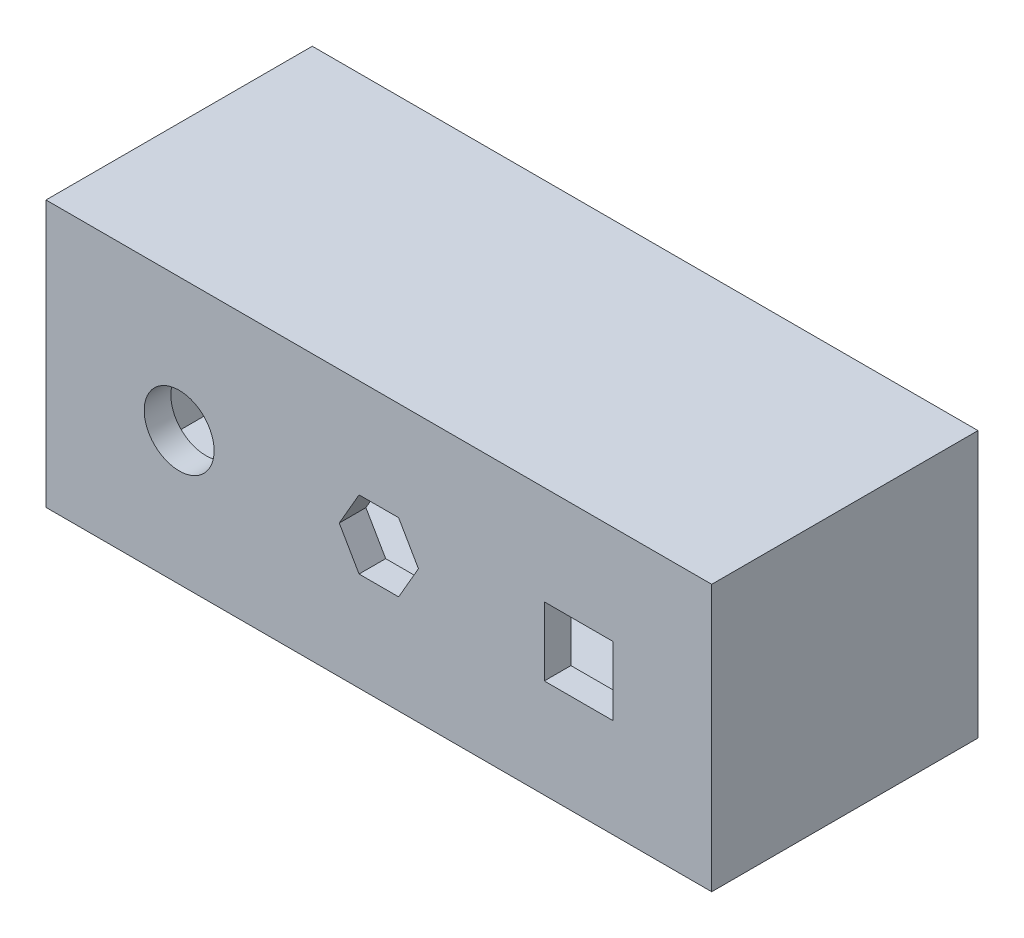
ISO-10303-21;
HEADER;
FILE_DESCRIPTION(('STEP AP214'),'2;1');
FILE_NAME('part.step','',(''),(''),'','','');
FILE_SCHEMA(('AUTOMOTIVE_DESIGN { 1 0 10303 214 1 1 1 1 }'));
ENDSEC;
DATA;
#1=APPLICATION_CONTEXT('core data for automotive mechanical design processes');
#2=APPLICATION_PROTOCOL_DEFINITION('international standard','automotive_design',2000,#1);
#3=PRODUCT_CONTEXT('',#1,'mechanical');
#4=PRODUCT('Part','Part','',(#3));
#5=PRODUCT_RELATED_PRODUCT_CATEGORY('part','',(#4));
#6=PRODUCT_DEFINITION_FORMATION('','',#4);
#7=PRODUCT_DEFINITION_CONTEXT('part definition',#1,'design');
#8=PRODUCT_DEFINITION('design','',#6,#7);
#9=PRODUCT_DEFINITION_SHAPE('','',#8);
#10=(LENGTH_UNIT() NAMED_UNIT(*) SI_UNIT(.MILLI.,.METRE.));
#11=(NAMED_UNIT(*) PLANE_ANGLE_UNIT() SI_UNIT($,.RADIAN.));
#12=(NAMED_UNIT(*) SI_UNIT($,.STERADIAN.) SOLID_ANGLE_UNIT());
#13=UNCERTAINTY_MEASURE_WITH_UNIT(LENGTH_MEASURE(1.E-05),#10,'distance_accuracy_value','');
#14=(GEOMETRIC_REPRESENTATION_CONTEXT(3) GLOBAL_UNCERTAINTY_ASSIGNED_CONTEXT((#13)) GLOBAL_UNIT_ASSIGNED_CONTEXT((#10,
#11,#12)) REPRESENTATION_CONTEXT('',''));
#15=CARTESIAN_POINT('',(0.,0.,0.));
#16=DIRECTION('',(0.,0.,1.));
#17=DIRECTION('',(1.,0.,0.));
#18=AXIS2_PLACEMENT_3D('',#15,#16,#17);
#19=CARTESIAN_POINT('',(0.,0.,0.));
#20=DIRECTION('',(0.,0.,-1.));
#21=DIRECTION('',(-1.,0.,0.));
#22=AXIS2_PLACEMENT_3D('',#19,#20,#21);
#23=PLANE('',#22);
#24=DIRECTION('',(0.,1.,0.));
#25=VECTOR('',#24,1.);
#26=CARTESIAN_POINT('',(250.,-100.,0.));
#27=LINE('',#26,#25);
#28=CARTESIAN_POINT('',(250.,-100.,0.));
#29=VERTEX_POINT('',#28);
#30=CARTESIAN_POINT('',(250.,100.,0.));
#31=VERTEX_POINT('',#30);
#32=EDGE_CURVE('E227',#29,#31,#27,.T.);
#33=ORIENTED_EDGE('',*,*,#32,.F.);
#34=DIRECTION('',(1.,0.,0.));
#35=VECTOR('',#34,1.);
#36=CARTESIAN_POINT('',(-250.,-100.,0.));
#37=LINE('',#36,#35);
#38=CARTESIAN_POINT('',(-250.,-100.,0.));
#39=VERTEX_POINT('',#38);
#40=EDGE_CURVE('E260',#39,#29,#37,.T.);
#41=ORIENTED_EDGE('',*,*,#40,.F.);
#42=DIRECTION('',(0.,-1.,0.));
#43=VECTOR('',#42,1.);
#44=CARTESIAN_POINT('',(-250.,-100.,0.));
#45=LINE('',#44,#43);
#46=CARTESIAN_POINT('',(-250.,100.,0.));
#47=VERTEX_POINT('',#46);
#48=EDGE_CURVE('E271',#47,#39,#45,.T.);
#49=ORIENTED_EDGE('',*,*,#48,.F.);
#50=DIRECTION('',(-1.,0.,0.));
#51=VECTOR('',#50,1.);
#52=CARTESIAN_POINT('',(-250.,100.,0.));
#53=LINE('',#52,#51);
#54=EDGE_CURVE('E269',#31,#47,#53,.T.);
#55=ORIENTED_EDGE('',*,*,#54,.F.);
#56=EDGE_LOOP('',(#33,#41,#49,#55));
#57=FACE_BOUND('',#56,.T.);
#58=DIRECTION('',(1.,0.,0.));
#59=VECTOR('',#58,1.);
#60=CARTESIAN_POINT('',(0.,-80.,0.));
#61=LINE('',#60,#59);
#62=CARTESIAN_POINT('',(-230.,-80.,0.));
#63=VERTEX_POINT('',#62);
#64=CARTESIAN_POINT('',(230.,-80.,0.));
#65=VERTEX_POINT('',#64);
#66=EDGE_CURVE('E233',#63,#65,#61,.T.);
#67=ORIENTED_EDGE('',*,*,#66,.T.);
#68=DIRECTION('',(0.,1.,0.));
#69=VECTOR('',#68,1.);
#70=CARTESIAN_POINT('',(230.,0.,0.));
#71=LINE('',#70,#69);
#72=CARTESIAN_POINT('',(230.,80.,0.));
#73=VERTEX_POINT('',#72);
#74=EDGE_CURVE('E245',#65,#73,#71,.T.);
#75=ORIENTED_EDGE('',*,*,#74,.T.);
#76=DIRECTION('',(-1.,0.,0.));
#77=VECTOR('',#76,1.);
#78=CARTESIAN_POINT('',(0.,80.,0.));
#79=LINE('',#78,#77);
#80=CARTESIAN_POINT('',(-230.,80.,0.));
#81=VERTEX_POINT('',#80);
#82=EDGE_CURVE('E248',#73,#81,#79,.T.);
#83=ORIENTED_EDGE('',*,*,#82,.T.);
#84=DIRECTION('',(0.,-1.,0.));
#85=VECTOR('',#84,1.);
#86=CARTESIAN_POINT('',(-230.,0.,0.));
#87=LINE('',#86,#85);
#88=EDGE_CURVE('E251',#81,#63,#87,.T.);
#89=ORIENTED_EDGE('',*,*,#88,.T.);
#90=EDGE_LOOP('',(#67,#75,#83,#89));
#91=FACE_BOUND('',#90,.T.);
#92=ADVANCED_FACE('F37',(#57,#91),#23,.T.);
#93=CARTESIAN_POINT('',(250.,-100.,200.));
#94=DIRECTION('',(-1.,0.,0.));
#95=DIRECTION('',(0.,0.,1.));
#96=AXIS2_PLACEMENT_3D('',#93,#94,#95);
#97=PLANE('',#96);
#98=ORIENTED_EDGE('',*,*,#32,.T.);
#99=DIRECTION('',(0.,0.,-1.));
#100=VECTOR('',#99,1.);
#101=CARTESIAN_POINT('',(250.,100.,200.));
#102=LINE('',#101,#100);
#103=CARTESIAN_POINT('',(250.,100.,200.));
#104=VERTEX_POINT('',#103);
#105=EDGE_CURVE('E282',#104,#31,#102,.T.);
#106=ORIENTED_EDGE('',*,*,#105,.F.);
#107=DIRECTION('',(0.,1.,0.));
#108=VECTOR('',#107,1.);
#109=CARTESIAN_POINT('',(250.,-100.,200.));
#110=LINE('',#109,#108);
#111=CARTESIAN_POINT('',(250.,-100.,200.));
#112=VERTEX_POINT('',#111);
#113=EDGE_CURVE('E256',#112,#104,#110,.T.);
#114=ORIENTED_EDGE('',*,*,#113,.F.);
#115=DIRECTION('',(0.,0.,-1.));
#116=VECTOR('',#115,1.);
#117=CARTESIAN_POINT('',(250.,-100.,200.));
#118=LINE('',#117,#116);
#119=EDGE_CURVE('E266',#112,#29,#118,.T.);
#120=ORIENTED_EDGE('',*,*,#119,.T.);
#121=EDGE_LOOP('',(#98,#106,#114,#120));
#122=FACE_BOUND('',#121,.T.);
#123=ADVANCED_FACE('F39',(#122),#97,.F.);
#124=CARTESIAN_POINT('',(-250.,100.,200.));
#125=DIRECTION('',(0.,-1.,0.));
#126=DIRECTION('',(0.,0.,-1.));
#127=AXIS2_PLACEMENT_3D('',#124,#125,#126);
#128=PLANE('',#127);
#129=ORIENTED_EDGE('',*,*,#54,.T.);
#130=DIRECTION('',(0.,0.,-1.));
#131=VECTOR('',#130,1.);
#132=CARTESIAN_POINT('',(-250.,100.,200.));
#133=LINE('',#132,#131);
#134=CARTESIAN_POINT('',(-250.,100.,200.));
#135=VERTEX_POINT('',#134);
#136=EDGE_CURVE('E279',#135,#47,#133,.T.);
#137=ORIENTED_EDGE('',*,*,#136,.F.);
#138=DIRECTION('',(-1.,0.,0.));
#139=VECTOR('',#138,1.);
#140=CARTESIAN_POINT('',(-250.,100.,200.));
#141=LINE('',#140,#139);
#142=EDGE_CURVE('E259',#104,#135,#141,.T.);
#143=ORIENTED_EDGE('',*,*,#142,.F.);
#144=ORIENTED_EDGE('',*,*,#105,.T.);
#145=EDGE_LOOP('',(#129,#137,#143,#144));
#146=FACE_BOUND('',#145,.T.);
#147=ADVANCED_FACE('F332',(#146),#128,.F.);
#148=CARTESIAN_POINT('',(-250.,-100.,200.));
#149=DIRECTION('',(1.,0.,0.));
#150=DIRECTION('',(0.,0.,-1.));
#151=AXIS2_PLACEMENT_3D('',#148,#149,#150);
#152=PLANE('',#151);
#153=ORIENTED_EDGE('',*,*,#48,.T.);
#154=DIRECTION('',(0.,0.,-1.));
#155=VECTOR('',#154,1.);
#156=CARTESIAN_POINT('',(-250.,-100.,200.));
#157=LINE('',#156,#155);
#158=CARTESIAN_POINT('',(-250.,-100.,200.));
#159=VERTEX_POINT('',#158);
#160=EDGE_CURVE('E276',#159,#39,#157,.T.);
#161=ORIENTED_EDGE('',*,*,#160,.F.);
#162=DIRECTION('',(0.,-1.,0.));
#163=VECTOR('',#162,1.);
#164=CARTESIAN_POINT('',(-250.,-100.,200.));
#165=LINE('',#164,#163);
#166=EDGE_CURVE('E262',#135,#159,#165,.T.);
#167=ORIENTED_EDGE('',*,*,#166,.F.);
#168=ORIENTED_EDGE('',*,*,#136,.T.);
#169=EDGE_LOOP('',(#153,#161,#167,#168));
#170=FACE_BOUND('',#169,.T.);
#171=ADVANCED_FACE('F337',(#170),#152,.F.);
#172=CARTESIAN_POINT('',(-250.,-100.,200.));
#173=DIRECTION('',(0.,1.,0.));
#174=DIRECTION('',(0.,0.,1.));
#175=AXIS2_PLACEMENT_3D('',#172,#173,#174);
#176=PLANE('',#175);
#177=ORIENTED_EDGE('',*,*,#40,.T.);
#178=ORIENTED_EDGE('',*,*,#119,.F.);
#179=DIRECTION('',(1.,0.,0.));
#180=VECTOR('',#179,1.);
#181=CARTESIAN_POINT('',(-250.,-100.,200.));
#182=LINE('',#181,#180);
#183=EDGE_CURVE('E264',#159,#112,#182,.T.);
#184=ORIENTED_EDGE('',*,*,#183,.F.);
#185=ORIENTED_EDGE('',*,*,#160,.T.);
#186=EDGE_LOOP('',(#177,#178,#184,#185));
#187=FACE_BOUND('',#186,.T.);
#188=ADVANCED_FACE('F319',(#187),#176,.F.);
#189=CARTESIAN_POINT('',(0.,0.,200.));
#190=DIRECTION('',(0.,0.,-1.));
#191=DIRECTION('',(-1.,0.,0.));
#192=AXIS2_PLACEMENT_3D('',#189,#190,#191);
#193=PLANE('',#192);
#194=DIRECTION('',(-1.,0.,0.));
#195=VECTOR('',#194,1.);
#196=CARTESIAN_POINT('',(124.25,25.75,200.));
#197=LINE('',#196,#195);
#198=CARTESIAN_POINT('',(175.75,25.75,200.));
#199=VERTEX_POINT('',#198);
#200=CARTESIAN_POINT('',(124.25,25.75,200.));
#201=VERTEX_POINT('',#200);
#202=EDGE_CURVE('E178',#199,#201,#197,.T.);
#203=ORIENTED_EDGE('',*,*,#202,.F.);
#204=DIRECTION('',(0.,1.,0.));
#205=VECTOR('',#204,1.);
#206=CARTESIAN_POINT('',(175.75,-25.7499999999999,200.));
#207=LINE('',#206,#205);
#208=CARTESIAN_POINT('',(175.75,-25.7499999999999,200.));
#209=VERTEX_POINT('',#208);
#210=EDGE_CURVE('E52',#209,#199,#207,.T.);
#211=ORIENTED_EDGE('',*,*,#210,.F.);
#212=DIRECTION('',(1.,0.,0.));
#213=VECTOR('',#212,1.);
#214=CARTESIAN_POINT('',(124.25,-25.7499999999999,200.));
#215=LINE('',#214,#213);
#216=CARTESIAN_POINT('',(124.25,-25.7499999999999,200.));
#217=VERTEX_POINT('',#216);
#218=EDGE_CURVE('E185',#217,#209,#215,.T.);
#219=ORIENTED_EDGE('',*,*,#218,.F.);
#220=DIRECTION('',(0.,-1.,0.));
#221=VECTOR('',#220,1.);
#222=CARTESIAN_POINT('',(124.25,-25.7499999999999,200.));
#223=LINE('',#222,#221);
#224=EDGE_CURVE('E168',#201,#217,#223,.T.);
#225=ORIENTED_EDGE('',*,*,#224,.F.);
#226=EDGE_LOOP('',(#203,#211,#219,#225));
#227=FACE_BOUND('',#226,.T.);
#228=CARTESIAN_POINT('',(-150.,0.,200.));
#229=DIRECTION('',(0.,0.,1.));
#230=DIRECTION('',(1.,0.,0.));
#231=AXIS2_PLACEMENT_3D('',#228,#229,#230);
#232=CIRCLE('',#231,26.25);
#233=CARTESIAN_POINT('',(-123.75,0.,200.));
#234=VERTEX_POINT('',#233);
#235=EDGE_CURVE('E192',#234,#234,#232,.T.);
#236=ORIENTED_EDGE('',*,*,#235,.F.);
#237=EDGE_LOOP('',(#236));
#238=FACE_BOUND('',#237,.T.);
#239=DIRECTION('',(-1.,0.,0.));
#240=VECTOR('',#239,1.);
#241=CARTESIAN_POINT('',(14.8667694316329,25.75,200.));
#242=LINE('',#241,#240);
#243=CARTESIAN_POINT('',(14.8667694316329,25.75,200.));
#244=VERTEX_POINT('',#243);
#245=CARTESIAN_POINT('',(-14.8667694316329,25.75,200.));
#246=VERTEX_POINT('',#245);
#247=EDGE_CURVE('E196',#244,#246,#242,.T.);
#248=ORIENTED_EDGE('',*,*,#247,.F.);
#249=DIRECTION('',(-0.5,0.866025403784439,0.));
#250=VECTOR('',#249,1.);
#251=CARTESIAN_POINT('',(29.7335388632657,0.,200.));
#252=LINE('',#251,#250);
#253=CARTESIAN_POINT('',(29.7335388632657,0.,200.));
#254=VERTEX_POINT('',#253);
#255=EDGE_CURVE('E60',#254,#244,#252,.T.);
#256=ORIENTED_EDGE('',*,*,#255,.F.);
#257=DIRECTION('',(0.5,0.866025403784439,0.));
#258=VECTOR('',#257,1.);
#259=CARTESIAN_POINT('',(14.8667694316329,-25.75,200.));
#260=LINE('',#259,#258);
#261=CARTESIAN_POINT('',(14.8667694316329,-25.75,200.));
#262=VERTEX_POINT('',#261);
#263=EDGE_CURVE('E208',#262,#254,#260,.T.);
#264=ORIENTED_EDGE('',*,*,#263,.F.);
#265=DIRECTION('',(1.,0.,0.));
#266=VECTOR('',#265,1.);
#267=CARTESIAN_POINT('',(-14.8667694316328,-25.75,200.));
#268=LINE('',#267,#266);
#269=CARTESIAN_POINT('',(-14.8667694316328,-25.75,200.));
#270=VERTEX_POINT('',#269);
#271=EDGE_CURVE('E205',#270,#262,#268,.T.);
#272=ORIENTED_EDGE('',*,*,#271,.F.);
#273=DIRECTION('',(0.5,-0.866025403784439,0.));
#274=VECTOR('',#273,1.);
#275=CARTESIAN_POINT('',(-29.7335388632657,0.,200.));
#276=LINE('',#275,#274);
#277=CARTESIAN_POINT('',(-29.7335388632657,0.,200.));
#278=VERTEX_POINT('',#277);
#279=EDGE_CURVE('E202',#278,#270,#276,.T.);
#280=ORIENTED_EDGE('',*,*,#279,.F.);
#281=DIRECTION('',(-0.5,-0.866025403784439,0.));
#282=VECTOR('',#281,1.);
#283=CARTESIAN_POINT('',(-14.8667694316329,25.75,200.));
#284=LINE('',#283,#282);
#285=EDGE_CURVE('E199',#246,#278,#284,.T.);
#286=ORIENTED_EDGE('',*,*,#285,.F.);
#287=EDGE_LOOP('',(#248,#256,#264,#272,#280,#286));
#288=FACE_BOUND('',#287,.T.);
#289=ORIENTED_EDGE('',*,*,#113,.T.);
#290=ORIENTED_EDGE('',*,*,#142,.T.);
#291=ORIENTED_EDGE('',*,*,#166,.T.);
#292=ORIENTED_EDGE('',*,*,#183,.T.);
#293=EDGE_LOOP('',(#289,#290,#291,#292));
#294=FACE_BOUND('',#293,.T.);
#295=ADVANCED_FACE('F182',(#227,#238,#288,#294),#193,.F.);
#296=CARTESIAN_POINT('',(230.,-100.,200.));
#297=DIRECTION('',(-1.,0.,0.));
#298=DIRECTION('',(0.,0.,1.));
#299=AXIS2_PLACEMENT_3D('',#296,#297,#298);
#300=PLANE('',#299);
#301=ORIENTED_EDGE('',*,*,#74,.F.);
#302=DIRECTION('',(0.,0.,-1.));
#303=VECTOR('',#302,1.);
#304=CARTESIAN_POINT('',(230.,-80.,200.));
#305=LINE('',#304,#303);
#306=CARTESIAN_POINT('',(230.,-80.,180.));
#307=VERTEX_POINT('',#306);
#308=EDGE_CURVE('E234',#307,#65,#305,.T.);
#309=ORIENTED_EDGE('',*,*,#308,.F.);
#310=DIRECTION('',(0.,1.,0.));
#311=VECTOR('',#310,1.);
#312=CARTESIAN_POINT('',(230.,0.,180.));
#313=LINE('',#312,#311);
#314=CARTESIAN_POINT('',(230.,80.,180.));
#315=VERTEX_POINT('',#314);
#316=EDGE_CURVE('E229',#307,#315,#313,.T.);
#317=ORIENTED_EDGE('',*,*,#316,.T.);
#318=DIRECTION('',(0.,0.,-1.));
#319=VECTOR('',#318,1.);
#320=CARTESIAN_POINT('',(230.,80.,200.));
#321=LINE('',#320,#319);
#322=EDGE_CURVE('E224',#315,#73,#321,.T.);
#323=ORIENTED_EDGE('',*,*,#322,.T.);
#324=EDGE_LOOP('',(#301,#309,#317,#323));
#325=FACE_BOUND('',#324,.T.);
#326=ADVANCED_FACE('F318',(#325),#300,.T.);
#327=CARTESIAN_POINT('',(-250.,80.,200.));
#328=DIRECTION('',(0.,-1.,0.));
#329=DIRECTION('',(0.,0.,-1.));
#330=AXIS2_PLACEMENT_3D('',#327,#328,#329);
#331=PLANE('',#330);
#332=ORIENTED_EDGE('',*,*,#82,.F.);
#333=ORIENTED_EDGE('',*,*,#322,.F.);
#334=DIRECTION('',(-1.,0.,0.));
#335=VECTOR('',#334,1.);
#336=CARTESIAN_POINT('',(0.,80.,180.));
#337=LINE('',#336,#335);
#338=CARTESIAN_POINT('',(-230.,80.,180.));
#339=VERTEX_POINT('',#338);
#340=EDGE_CURVE('E232',#315,#339,#337,.T.);
#341=ORIENTED_EDGE('',*,*,#340,.T.);
#342=DIRECTION('',(0.,0.,-1.));
#343=VECTOR('',#342,1.);
#344=CARTESIAN_POINT('',(-230.,80.,200.));
#345=LINE('',#344,#343);
#346=EDGE_CURVE('E228',#339,#81,#345,.T.);
#347=ORIENTED_EDGE('',*,*,#346,.T.);
#348=EDGE_LOOP('',(#332,#333,#341,#347));
#349=FACE_BOUND('',#348,.T.);
#350=ADVANCED_FACE('F355',(#349),#331,.T.);
#351=CARTESIAN_POINT('',(-230.,-100.,200.));
#352=DIRECTION('',(1.,0.,0.));
#353=DIRECTION('',(0.,0.,-1.));
#354=AXIS2_PLACEMENT_3D('',#351,#352,#353);
#355=PLANE('',#354);
#356=ORIENTED_EDGE('',*,*,#88,.F.);
#357=ORIENTED_EDGE('',*,*,#346,.F.);
#358=DIRECTION('',(0.,-1.,0.));
#359=VECTOR('',#358,1.);
#360=CARTESIAN_POINT('',(-230.,0.,180.));
#361=LINE('',#360,#359);
#362=CARTESIAN_POINT('',(-230.,-80.,180.));
#363=VERTEX_POINT('',#362);
#364=EDGE_CURVE('E241',#339,#363,#361,.T.);
#365=ORIENTED_EDGE('',*,*,#364,.T.);
#366=DIRECTION('',(0.,0.,-1.));
#367=VECTOR('',#366,1.);
#368=CARTESIAN_POINT('',(-230.,-80.,200.));
#369=LINE('',#368,#367);
#370=EDGE_CURVE('E236',#363,#63,#369,.T.);
#371=ORIENTED_EDGE('',*,*,#370,.T.);
#372=EDGE_LOOP('',(#356,#357,#365,#371));
#373=FACE_BOUND('',#372,.T.);
#374=ADVANCED_FACE('F359',(#373),#355,.T.);
#375=CARTESIAN_POINT('',(-250.,-80.,200.));
#376=DIRECTION('',(0.,1.,0.));
#377=DIRECTION('',(0.,0.,1.));
#378=AXIS2_PLACEMENT_3D('',#375,#376,#377);
#379=PLANE('',#378);
#380=ORIENTED_EDGE('',*,*,#66,.F.);
#381=ORIENTED_EDGE('',*,*,#370,.F.);
#382=DIRECTION('',(1.,0.,0.));
#383=VECTOR('',#382,1.);
#384=CARTESIAN_POINT('',(0.,-80.,180.));
#385=LINE('',#384,#383);
#386=EDGE_CURVE('E237',#363,#307,#385,.T.);
#387=ORIENTED_EDGE('',*,*,#386,.T.);
#388=ORIENTED_EDGE('',*,*,#308,.T.);
#389=EDGE_LOOP('',(#380,#381,#387,#388));
#390=FACE_BOUND('',#389,.T.);
#391=ADVANCED_FACE('F348',(#390),#379,.T.);
#392=CARTESIAN_POINT('',(0.,0.,180.));
#393=DIRECTION('',(0.,0.,-1.));
#394=DIRECTION('',(-1.,0.,0.));
#395=AXIS2_PLACEMENT_3D('',#392,#393,#394);
#396=PLANE('',#395);
#397=DIRECTION('',(0.,-1.,0.));
#398=VECTOR('',#397,1.);
#399=CARTESIAN_POINT('',(175.75,0.,180.));
#400=LINE('',#399,#398);
#401=CARTESIAN_POINT('',(175.75,25.75,180.));
#402=VERTEX_POINT('',#401);
#403=CARTESIAN_POINT('',(175.75,-25.7499999999999,180.));
#404=VERTEX_POINT('',#403);
#405=EDGE_CURVE('E11',#402,#404,#400,.T.);
#406=ORIENTED_EDGE('',*,*,#405,.F.);
#407=DIRECTION('',(1.,0.,0.));
#408=VECTOR('',#407,1.);
#409=CARTESIAN_POINT('',(0.,25.75,180.));
#410=LINE('',#409,#408);
#411=CARTESIAN_POINT('',(124.25,25.75,180.));
#412=VERTEX_POINT('',#411);
#413=EDGE_CURVE('E298',#412,#402,#410,.T.);
#414=ORIENTED_EDGE('',*,*,#413,.F.);
#415=DIRECTION('',(0.,1.,0.));
#416=VECTOR('',#415,1.);
#417=CARTESIAN_POINT('',(124.25,0.,180.));
#418=LINE('',#417,#416);
#419=CARTESIAN_POINT('',(124.25,-25.7499999999999,180.));
#420=VERTEX_POINT('',#419);
#421=EDGE_CURVE('E171',#420,#412,#418,.T.);
#422=ORIENTED_EDGE('',*,*,#421,.F.);
#423=DIRECTION('',(-1.,0.,0.));
#424=VECTOR('',#423,1.);
#425=CARTESIAN_POINT('',(0.,-25.7499999999999,180.));
#426=LINE('',#425,#424);
#427=EDGE_CURVE('E45',#404,#420,#426,.T.);
#428=ORIENTED_EDGE('',*,*,#427,.F.);
#429=EDGE_LOOP('',(#406,#414,#422,#428));
#430=FACE_BOUND('',#429,.T.);
#431=CARTESIAN_POINT('',(-150.,0.,180.));
#432=DIRECTION('',(0.,0.,-1.));
#433=DIRECTION('',(-1.,0.,0.));
#434=AXIS2_PLACEMENT_3D('',#431,#432,#433);
#435=CIRCLE('',#434,26.25);
#436=CARTESIAN_POINT('',(-176.25,0.,180.));
#437=VERTEX_POINT('',#436);
#438=EDGE_CURVE('E214',#437,#437,#435,.T.);
#439=ORIENTED_EDGE('',*,*,#438,.F.);
#440=EDGE_LOOP('',(#439));
#441=FACE_BOUND('',#440,.T.);
#442=DIRECTION('',(0.5,-0.866025403784439,0.));
#443=VECTOR('',#442,1.);
#444=CARTESIAN_POINT('',(22.3001541474493,12.875,180.));
#445=LINE('',#444,#443);
#446=CARTESIAN_POINT('',(14.8667694316329,25.75,180.));
#447=VERTEX_POINT('',#446);
#448=CARTESIAN_POINT('',(29.7335388632657,0.,180.));
#449=VERTEX_POINT('',#448);
#450=EDGE_CURVE('E296',#447,#449,#445,.T.);
#451=ORIENTED_EDGE('',*,*,#450,.F.);
#452=DIRECTION('',(1.,0.,0.));
#453=VECTOR('',#452,1.);
#454=CARTESIAN_POINT('',(0.,25.75,180.));
#455=LINE('',#454,#453);
#456=CARTESIAN_POINT('',(-14.8667694316329,25.75,180.));
#457=VERTEX_POINT('',#456);
#458=EDGE_CURVE('E285',#457,#447,#455,.T.);
#459=ORIENTED_EDGE('',*,*,#458,.F.);
#460=DIRECTION('',(0.5,0.866025403784439,0.));
#461=VECTOR('',#460,1.);
#462=CARTESIAN_POINT('',(-22.3001541474493,12.875,180.));
#463=LINE('',#462,#461);
#464=CARTESIAN_POINT('',(-29.7335388632657,0.,180.));
#465=VERTEX_POINT('',#464);
#466=EDGE_CURVE('E287',#465,#457,#463,.T.);
#467=ORIENTED_EDGE('',*,*,#466,.F.);
#468=DIRECTION('',(-0.5,0.866025403784439,0.));
#469=VECTOR('',#468,1.);
#470=CARTESIAN_POINT('',(-22.3001541474493,-12.875,180.));
#471=LINE('',#470,#469);
#472=CARTESIAN_POINT('',(-14.8667694316328,-25.75,180.));
#473=VERTEX_POINT('',#472);
#474=EDGE_CURVE('E290',#473,#465,#471,.T.);
#475=ORIENTED_EDGE('',*,*,#474,.F.);
#476=DIRECTION('',(-1.,0.,0.));
#477=VECTOR('',#476,1.);
#478=CARTESIAN_POINT('',(0.,-25.75,180.));
#479=LINE('',#478,#477);
#480=CARTESIAN_POINT('',(14.8667694316329,-25.75,180.));
#481=VERTEX_POINT('',#480);
#482=EDGE_CURVE('E292',#481,#473,#479,.T.);
#483=ORIENTED_EDGE('',*,*,#482,.F.);
#484=DIRECTION('',(-0.5,-0.866025403784439,0.));
#485=VECTOR('',#484,1.);
#486=CARTESIAN_POINT('',(22.3001541474493,-12.875,180.));
#487=LINE('',#486,#485);
#488=EDGE_CURVE('E294',#449,#481,#487,.T.);
#489=ORIENTED_EDGE('',*,*,#488,.F.);
#490=EDGE_LOOP('',(#451,#459,#467,#475,#483,#489));
#491=FACE_BOUND('',#490,.T.);
#492=ORIENTED_EDGE('',*,*,#316,.F.);
#493=ORIENTED_EDGE('',*,*,#386,.F.);
#494=ORIENTED_EDGE('',*,*,#364,.F.);
#495=ORIENTED_EDGE('',*,*,#340,.F.);
#496=EDGE_LOOP('',(#492,#493,#494,#495));
#497=FACE_BOUND('',#496,.T.);
#498=ADVANCED_FACE('F308',(#430,#441,#491,#497),#396,.T.);
#499=CARTESIAN_POINT('',(29.7335388632657,0.,148.4));
#500=DIRECTION('',(0.866025403784439,0.5,0.));
#501=DIRECTION('',(-0.5,0.866025403784439,0.));
#502=AXIS2_PLACEMENT_3D('',#499,#500,#501);
#503=PLANE('',#502);
#504=ORIENTED_EDGE('',*,*,#450,.T.);
#505=DIRECTION('',(0.,0.,1.));
#506=VECTOR('',#505,1.);
#507=CARTESIAN_POINT('',(29.7335388632657,0.,148.4));
#508=LINE('',#507,#506);
#509=EDGE_CURVE('E212',#449,#254,#508,.T.);
#510=ORIENTED_EDGE('',*,*,#509,.T.);
#511=ORIENTED_EDGE('',*,*,#255,.T.);
#512=DIRECTION('',(0.,0.,1.));
#513=VECTOR('',#512,1.);
#514=CARTESIAN_POINT('',(14.8667694316329,25.75,148.4));
#515=LINE('',#514,#513);
#516=EDGE_CURVE('E211',#447,#244,#515,.T.);
#517=ORIENTED_EDGE('',*,*,#516,.F.);
#518=EDGE_LOOP('',(#504,#510,#511,#517));
#519=FACE_BOUND('',#518,.T.);
#520=ADVANCED_FACE('F362',(#519),#503,.F.);
#521=CARTESIAN_POINT('',(14.8667694316329,-25.75,148.4));
#522=DIRECTION('',(0.866025403784439,-0.5,0.));
#523=DIRECTION('',(0.5,0.866025403784439,0.));
#524=AXIS2_PLACEMENT_3D('',#521,#522,#523);
#525=PLANE('',#524);
#526=ORIENTED_EDGE('',*,*,#488,.T.);
#527=DIRECTION('',(0.,0.,1.));
#528=VECTOR('',#527,1.);
#529=CARTESIAN_POINT('',(14.8667694316329,-25.75,148.4));
#530=LINE('',#529,#528);
#531=EDGE_CURVE('E215',#481,#262,#530,.T.);
#532=ORIENTED_EDGE('',*,*,#531,.T.);
#533=ORIENTED_EDGE('',*,*,#263,.T.);
#534=ORIENTED_EDGE('',*,*,#509,.F.);
#535=EDGE_LOOP('',(#526,#532,#533,#534));
#536=FACE_BOUND('',#535,.T.);
#537=ADVANCED_FACE('F368',(#536),#525,.F.);
#538=CARTESIAN_POINT('',(-14.8667694316328,-25.75,148.4));
#539=DIRECTION('',(0.,-1.,0.));
#540=DIRECTION('',(1.,0.,0.));
#541=AXIS2_PLACEMENT_3D('',#538,#539,#540);
#542=PLANE('',#541);
#543=ORIENTED_EDGE('',*,*,#482,.T.);
#544=DIRECTION('',(0.,0.,1.));
#545=VECTOR('',#544,1.);
#546=CARTESIAN_POINT('',(-14.8667694316328,-25.75,148.4));
#547=LINE('',#546,#545);
#548=EDGE_CURVE('E217',#473,#270,#547,.T.);
#549=ORIENTED_EDGE('',*,*,#548,.T.);
#550=ORIENTED_EDGE('',*,*,#271,.T.);
#551=ORIENTED_EDGE('',*,*,#531,.F.);
#552=EDGE_LOOP('',(#543,#549,#550,#551));
#553=FACE_BOUND('',#552,.T.);
#554=ADVANCED_FACE('F444',(#553),#542,.F.);
#555=CARTESIAN_POINT('',(-29.7335388632657,0.,148.4));
#556=DIRECTION('',(-0.866025403784439,-0.5,0.));
#557=DIRECTION('',(0.5,-0.866025403784439,0.));
#558=AXIS2_PLACEMENT_3D('',#555,#556,#557);
#559=PLANE('',#558);
#560=ORIENTED_EDGE('',*,*,#474,.T.);
#561=DIRECTION('',(0.,0.,1.));
#562=VECTOR('',#561,1.);
#563=CARTESIAN_POINT('',(-29.7335388632657,0.,148.4));
#564=LINE('',#563,#562);
#565=EDGE_CURVE('E219',#465,#278,#564,.T.);
#566=ORIENTED_EDGE('',*,*,#565,.T.);
#567=ORIENTED_EDGE('',*,*,#279,.T.);
#568=ORIENTED_EDGE('',*,*,#548,.F.);
#569=EDGE_LOOP('',(#560,#566,#567,#568));
#570=FACE_BOUND('',#569,.T.);
#571=ADVANCED_FACE('F454',(#570),#559,.F.);
#572=CARTESIAN_POINT('',(-14.8667694316329,25.75,148.4));
#573=DIRECTION('',(-0.866025403784439,0.5,0.));
#574=DIRECTION('',(-0.5,-0.866025403784439,0.));
#575=AXIS2_PLACEMENT_3D('',#572,#573,#574);
#576=PLANE('',#575);
#577=ORIENTED_EDGE('',*,*,#466,.T.);
#578=DIRECTION('',(0.,0.,1.));
#579=VECTOR('',#578,1.);
#580=CARTESIAN_POINT('',(-14.8667694316329,25.75,148.4));
#581=LINE('',#580,#579);
#582=EDGE_CURVE('E221',#457,#246,#581,.T.);
#583=ORIENTED_EDGE('',*,*,#582,.T.);
#584=ORIENTED_EDGE('',*,*,#285,.T.);
#585=ORIENTED_EDGE('',*,*,#565,.F.);
#586=EDGE_LOOP('',(#577,#583,#584,#585));
#587=FACE_BOUND('',#586,.T.);
#588=ADVANCED_FACE('F464',(#587),#576,.F.);
#589=CARTESIAN_POINT('',(14.8667694316329,25.75,148.4));
#590=DIRECTION('',(0.,1.,0.));
#591=DIRECTION('',(-1.,0.,0.));
#592=AXIS2_PLACEMENT_3D('',#589,#590,#591);
#593=PLANE('',#592);
#594=ORIENTED_EDGE('',*,*,#458,.T.);
#595=ORIENTED_EDGE('',*,*,#516,.T.);
#596=ORIENTED_EDGE('',*,*,#247,.T.);
#597=ORIENTED_EDGE('',*,*,#582,.F.);
#598=EDGE_LOOP('',(#594,#595,#596,#597));
#599=FACE_BOUND('',#598,.T.);
#600=ADVANCED_FACE('F474',(#599),#593,.F.);
#601=CARTESIAN_POINT('',(-150.,0.,148.4));
#602=DIRECTION('',(0.,0.,1.));
#603=DIRECTION('',(1.,0.,0.));
#604=AXIS2_PLACEMENT_3D('',#601,#602,#603);
#605=CYLINDRICAL_SURFACE('',#604,26.25);
#606=ORIENTED_EDGE('',*,*,#438,.T.);
#607=EDGE_LOOP('',(#606));
#608=FACE_BOUND('',#607,.T.);
#609=ORIENTED_EDGE('',*,*,#235,.T.);
#610=EDGE_LOOP('',(#609));
#611=FACE_BOUND('',#610,.T.);
#612=ADVANCED_FACE('F315',(#608,#611),#605,.F.);
#613=CARTESIAN_POINT('',(175.75,-25.7499999999999,148.4));
#614=DIRECTION('',(1.,0.,0.));
#615=DIRECTION('',(0.,0.,-1.));
#616=AXIS2_PLACEMENT_3D('',#613,#614,#615);
#617=PLANE('',#616);
#618=ORIENTED_EDGE('',*,*,#405,.T.);
#619=DIRECTION('',(0.,0.,1.));
#620=VECTOR('',#619,1.);
#621=CARTESIAN_POINT('',(175.75,-25.7499999999999,148.4));
#622=LINE('',#621,#620);
#623=EDGE_CURVE('E190',#404,#209,#622,.T.);
#624=ORIENTED_EDGE('',*,*,#623,.T.);
#625=ORIENTED_EDGE('',*,*,#210,.T.);
#626=DIRECTION('',(0.,0.,1.));
#627=VECTOR('',#626,1.);
#628=CARTESIAN_POINT('',(175.75,25.75,148.4));
#629=LINE('',#628,#627);
#630=EDGE_CURVE('E175',#402,#199,#629,.T.);
#631=ORIENTED_EDGE('',*,*,#630,.F.);
#632=EDGE_LOOP('',(#618,#624,#625,#631));
#633=FACE_BOUND('',#632,.T.);
#634=ADVANCED_FACE('F310',(#633),#617,.F.);
#635=CARTESIAN_POINT('',(124.25,-25.7499999999999,148.4));
#636=DIRECTION('',(0.,-1.,0.));
#637=DIRECTION('',(0.,0.,-1.));
#638=AXIS2_PLACEMENT_3D('',#635,#636,#637);
#639=PLANE('',#638);
#640=ORIENTED_EDGE('',*,*,#427,.T.);
#641=DIRECTION('',(0.,0.,1.));
#642=VECTOR('',#641,1.);
#643=CARTESIAN_POINT('',(124.25,-25.7499999999999,148.4));
#644=LINE('',#643,#642);
#645=EDGE_CURVE('E174',#420,#217,#644,.T.);
#646=ORIENTED_EDGE('',*,*,#645,.T.);
#647=ORIENTED_EDGE('',*,*,#218,.T.);
#648=ORIENTED_EDGE('',*,*,#623,.F.);
#649=EDGE_LOOP('',(#640,#646,#647,#648));
#650=FACE_BOUND('',#649,.T.);
#651=ADVANCED_FACE('F305',(#650),#639,.F.);
#652=CARTESIAN_POINT('',(124.25,-25.7499999999999,148.4));
#653=DIRECTION('',(-1.,0.,0.));
#654=DIRECTION('',(0.,0.,1.));
#655=AXIS2_PLACEMENT_3D('',#652,#653,#654);
#656=PLANE('',#655);
#657=ORIENTED_EDGE('',*,*,#421,.T.);
#658=DIRECTION('',(0.,0.,1.));
#659=VECTOR('',#658,1.);
#660=CARTESIAN_POINT('',(124.25,25.75,148.4));
#661=LINE('',#660,#659);
#662=EDGE_CURVE('E163',#412,#201,#661,.T.);
#663=ORIENTED_EDGE('',*,*,#662,.T.);
#664=ORIENTED_EDGE('',*,*,#224,.T.);
#665=ORIENTED_EDGE('',*,*,#645,.F.);
#666=EDGE_LOOP('',(#657,#663,#664,#665));
#667=FACE_BOUND('',#666,.T.);
#668=ADVANCED_FACE('F165',(#667),#656,.F.);
#669=CARTESIAN_POINT('',(124.25,25.75,148.4));
#670=DIRECTION('',(0.,1.,0.));
#671=DIRECTION('',(0.,0.,1.));
#672=AXIS2_PLACEMENT_3D('',#669,#670,#671);
#673=PLANE('',#672);
#674=ORIENTED_EDGE('',*,*,#413,.T.);
#675=ORIENTED_EDGE('',*,*,#630,.T.);
#676=ORIENTED_EDGE('',*,*,#202,.T.);
#677=ORIENTED_EDGE('',*,*,#662,.F.);
#678=EDGE_LOOP('',(#674,#675,#676,#677));
#679=FACE_BOUND('',#678,.T.);
#680=ADVANCED_FACE('F179',(#679),#673,.F.);
#681=CLOSED_SHELL('',(#92,#123,#147,#171,#188,#295,#326,#350,#374,#391,#498,#520,#537,#554,#571,
#588,#600,#612,#634,#651,#668,#680));
#682=MANIFOLD_SOLID_BREP('B2',#681);
#683=ADVANCED_BREP_SHAPE_REPRESENTATION('',(#18,#682),#14);
#684=SHAPE_DEFINITION_REPRESENTATION(#9,#683);
ENDSEC;
END-ISO-10303-21;
